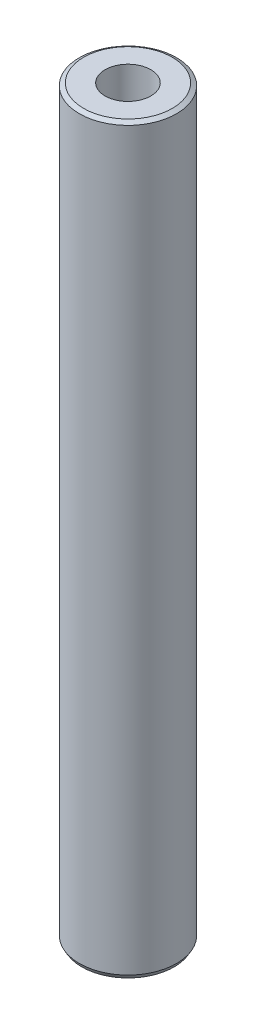
ISO-10303-21;
HEADER;
FILE_DESCRIPTION(('STEP AP214'),'2;1');
FILE_NAME('part.step','',(''),(''),'','','');
FILE_SCHEMA(('AUTOMOTIVE_DESIGN { 1 0 10303 214 1 1 1 1 }'));
ENDSEC;
DATA;
#1=APPLICATION_CONTEXT('core data for automotive mechanical design processes');
#2=APPLICATION_PROTOCOL_DEFINITION('international standard','automotive_design',2000,#1);
#3=PRODUCT_CONTEXT('',#1,'mechanical');
#4=PRODUCT('Part','Part','',(#3));
#5=PRODUCT_RELATED_PRODUCT_CATEGORY('part','',(#4));
#6=PRODUCT_DEFINITION_FORMATION('','',#4);
#7=PRODUCT_DEFINITION_CONTEXT('part definition',#1,'design');
#8=PRODUCT_DEFINITION('design','',#6,#7);
#9=PRODUCT_DEFINITION_SHAPE('','',#8);
#10=(LENGTH_UNIT() NAMED_UNIT(*) SI_UNIT(.MILLI.,.METRE.));
#11=(NAMED_UNIT(*) PLANE_ANGLE_UNIT() SI_UNIT($,.RADIAN.));
#12=(NAMED_UNIT(*) SI_UNIT($,.STERADIAN.) SOLID_ANGLE_UNIT());
#13=UNCERTAINTY_MEASURE_WITH_UNIT(LENGTH_MEASURE(1.E-05),#10,'distance_accuracy_value','');
#14=(GEOMETRIC_REPRESENTATION_CONTEXT(3) GLOBAL_UNCERTAINTY_ASSIGNED_CONTEXT((#13)) GLOBAL_UNIT_ASSIGNED_CONTEXT((#10,
#11,#12)) REPRESENTATION_CONTEXT('',''));
#15=CARTESIAN_POINT('',(0.,0.,0.));
#16=DIRECTION('',(0.,0.,1.));
#17=DIRECTION('',(1.,0.,0.));
#18=AXIS2_PLACEMENT_3D('',#15,#16,#17);
#19=CARTESIAN_POINT('',(0.,114.585905106585,0.));
#20=DIRECTION('',(0.,-1.,0.));
#21=DIRECTION('',(0.,0.,-1.));
#22=AXIS2_PLACEMENT_3D('',#19,#20,#21);
#23=CYLINDRICAL_SURFACE('',#22,7.5);
#24=CARTESIAN_POINT('',(0.,114.204842115201,0.));
#25=DIRECTION('',(0.,1.,0.));
#26=DIRECTION('',(0.,0.,1.));
#27=AXIS2_PLACEMENT_3D('',#24,#25,#26);
#28=CIRCLE('',#27,7.5);
#29=CARTESIAN_POINT('',(0.,114.204842115201,7.5));
#30=VERTEX_POINT('',#29);
#31=EDGE_CURVE('E50',#30,#30,#28,.F.);
#32=ORIENTED_EDGE('',*,*,#31,.T.);
#33=EDGE_LOOP('',(#32));
#34=FACE_BOUND('',#33,.T.);
#35=CARTESIAN_POINT('',(0.,0.660020461961036,0.));
#36=DIRECTION('',(0.,1.,0.));
#37=DIRECTION('',(0.,0.,1.));
#38=AXIS2_PLACEMENT_3D('',#35,#36,#37);
#39=CIRCLE('',#38,7.5);
#40=CARTESIAN_POINT('',(0.,0.660020461961036,7.5));
#41=VERTEX_POINT('',#40);
#42=EDGE_CURVE('E51',#41,#41,#39,.T.);
#43=ORIENTED_EDGE('',*,*,#42,.T.);
#44=EDGE_LOOP('',(#43));
#45=FACE_BOUND('',#44,.T.);
#46=ADVANCED_FACE('F39',(#34,#45),#23,.T.);
#47=CARTESIAN_POINT('',(0.,114.585905106585,0.));
#48=DIRECTION('',(0.,1.,0.));
#49=DIRECTION('',(0.,0.,1.));
#50=AXIS2_PLACEMENT_3D('',#47,#48,#49);
#51=PLANE('',#50);
#52=CARTESIAN_POINT('',(0.,114.585905106585,0.));
#53=DIRECTION('',(0.,1.,0.));
#54=DIRECTION('',(0.,0.,1.));
#55=AXIS2_PLACEMENT_3D('',#52,#53,#54);
#56=CIRCLE('',#55,6.83997953803893);
#57=CARTESIAN_POINT('',(0.,114.585905106585,6.83997953803893));
#58=VERTEX_POINT('',#57);
#59=EDGE_CURVE('E54',#58,#58,#56,.T.);
#60=ORIENTED_EDGE('',*,*,#59,.T.);
#61=EDGE_LOOP('',(#60));
#62=FACE_BOUND('',#61,.T.);
#63=CARTESIAN_POINT('',(0.,114.585905106585,0.));
#64=DIRECTION('',(0.,1.,0.));
#65=DIRECTION('',(0.,0.,1.));
#66=AXIS2_PLACEMENT_3D('',#63,#64,#65);
#67=CIRCLE('',#66,3.52489360641528);
#68=CARTESIAN_POINT('',(0.,114.585905106585,3.52489360641528));
#69=VERTEX_POINT('',#68);
#70=EDGE_CURVE('E58',#69,#69,#67,.T.);
#71=ORIENTED_EDGE('',*,*,#70,.F.);
#72=EDGE_LOOP('',(#71));
#73=FACE_BOUND('',#72,.T.);
#74=ADVANCED_FACE('F69',(#62,#73),#51,.T.);
#75=CARTESIAN_POINT('',(0.,0.,0.));
#76=DIRECTION('',(0.,1.,0.));
#77=DIRECTION('',(0.,0.,1.));
#78=AXIS2_PLACEMENT_3D('',#75,#76,#77);
#79=PLANE('',#78);
#80=CARTESIAN_POINT('',(0.,0.,0.));
#81=DIRECTION('',(0.,1.,0.));
#82=DIRECTION('',(0.,0.,1.));
#83=AXIS2_PLACEMENT_3D('',#80,#81,#82);
#84=CIRCLE('',#83,7.11893700861613);
#85=CARTESIAN_POINT('',(0.,0.,7.11893700861613));
#86=VERTEX_POINT('',#85);
#87=EDGE_CURVE('E10',#86,#86,#84,.F.);
#88=ORIENTED_EDGE('',*,*,#87,.T.);
#89=EDGE_LOOP('',(#88));
#90=FACE_BOUND('',#89,.T.);
#91=CARTESIAN_POINT('',(0.,0.,0.));
#92=DIRECTION('',(0.,1.,0.));
#93=DIRECTION('',(0.,0.,1.));
#94=AXIS2_PLACEMENT_3D('',#91,#92,#93);
#95=CIRCLE('',#94,3.52489360641528);
#96=CARTESIAN_POINT('',(0.,0.,3.52489360641528));
#97=VERTEX_POINT('',#96);
#98=EDGE_CURVE('E63',#97,#97,#95,.T.);
#99=ORIENTED_EDGE('',*,*,#98,.T.);
#100=EDGE_LOOP('',(#99));
#101=FACE_BOUND('',#100,.T.);
#102=ADVANCED_FACE('F75',(#90,#101),#79,.F.);
#103=CARTESIAN_POINT('',(0.,114.585905106585,0.));
#104=DIRECTION('',(0.,-1.,0.));
#105=DIRECTION('',(0.,0.,-1.));
#106=AXIS2_PLACEMENT_3D('',#103,#104,#105);
#107=CYLINDRICAL_SURFACE('',#106,3.52489360641528);
#108=ORIENTED_EDGE('',*,*,#70,.T.);
#109=EDGE_LOOP('',(#108));
#110=FACE_BOUND('',#109,.T.);
#111=ORIENTED_EDGE('',*,*,#98,.F.);
#112=EDGE_LOOP('',(#111));
#113=FACE_BOUND('',#112,.T.);
#114=ADVANCED_FACE('F70',(#110,#113),#107,.F.);
#115=CARTESIAN_POINT('',(0.,114.585905106585,0.));
#116=DIRECTION('',(0.,-1.,0.));
#117=DIRECTION('',(0.,0.,-1.));
#118=AXIS2_PLACEMENT_3D('',#115,#116,#117);
#119=CONICAL_SURFACE('',#118,6.83997953803893,1.04719755119659);
#120=ORIENTED_EDGE('',*,*,#31,.F.);
#121=EDGE_LOOP('',(#120));
#122=FACE_BOUND('',#121,.T.);
#123=ORIENTED_EDGE('',*,*,#59,.F.);
#124=EDGE_LOOP('',(#123));
#125=FACE_BOUND('',#124,.T.);
#126=ADVANCED_FACE('F81',(#122,#125),#119,.T.);
#127=CARTESIAN_POINT('',(0.,0.660020461961036,0.));
#128=DIRECTION('',(0.,1.,0.));
#129=DIRECTION('',(0.,0.,1.));
#130=AXIS2_PLACEMENT_3D('',#127,#128,#129);
#131=CONICAL_SURFACE('',#130,7.5,0.523598775598307);
#132=ORIENTED_EDGE('',*,*,#87,.F.);
#133=EDGE_LOOP('',(#132));
#134=FACE_BOUND('',#133,.T.);
#135=ORIENTED_EDGE('',*,*,#42,.F.);
#136=EDGE_LOOP('',(#135));
#137=FACE_BOUND('',#136,.T.);
#138=ADVANCED_FACE('F45',(#134,#137),#131,.T.);
#139=CLOSED_SHELL('',(#46,#74,#102,#114,#126,#138));
#140=MANIFOLD_SOLID_BREP('B2',#139);
#141=ADVANCED_BREP_SHAPE_REPRESENTATION('',(#18,#140),#14);
#142=SHAPE_DEFINITION_REPRESENTATION(#9,#141);
ENDSEC;
END-ISO-10303-21;
